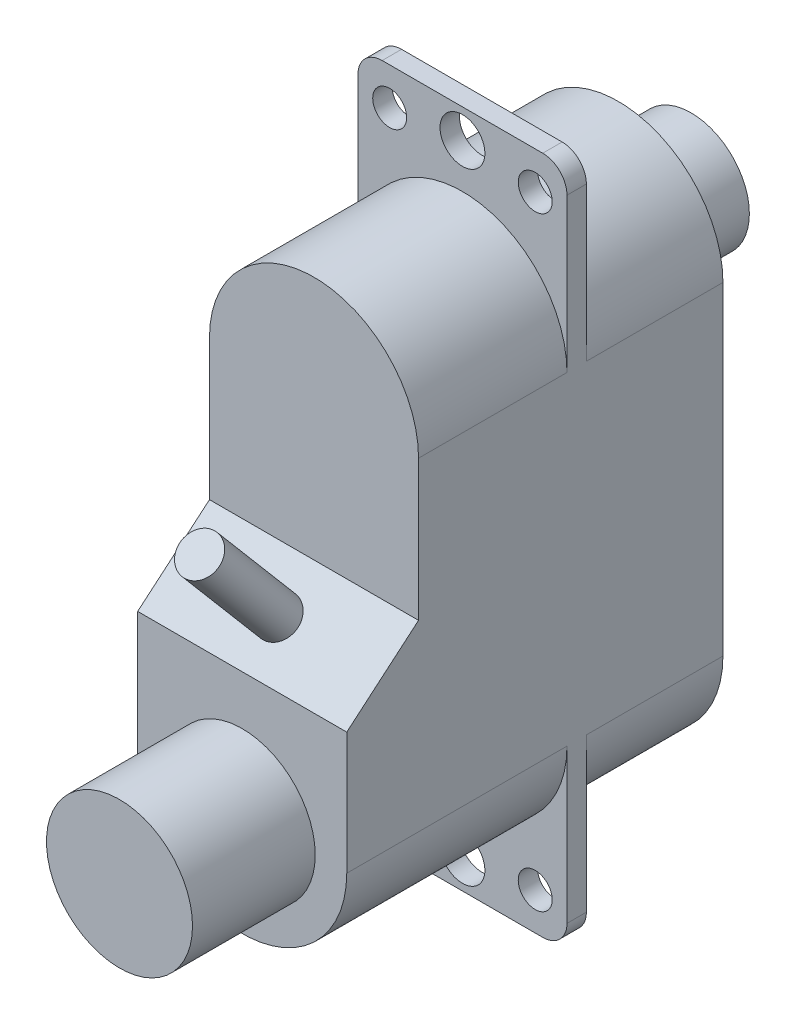
ISO-10303-21;
HEADER;
FILE_DESCRIPTION(('STEP AP214'),'2;1');
FILE_NAME('part.step','',(''),(''),'','','');
FILE_SCHEMA(('AUTOMOTIVE_DESIGN { 1 0 10303 214 1 1 1 1 }'));
ENDSEC;
DATA;
#1=APPLICATION_CONTEXT('core data for automotive mechanical design processes');
#2=APPLICATION_PROTOCOL_DEFINITION('international standard','automotive_design',2000,#1);
#3=PRODUCT_CONTEXT('',#1,'mechanical');
#4=PRODUCT('Part','Part','',(#3));
#5=PRODUCT_RELATED_PRODUCT_CATEGORY('part','',(#4));
#6=PRODUCT_DEFINITION_FORMATION('','',#4);
#7=PRODUCT_DEFINITION_CONTEXT('part definition',#1,'design');
#8=PRODUCT_DEFINITION('design','',#6,#7);
#9=PRODUCT_DEFINITION_SHAPE('','',#8);
#10=(LENGTH_UNIT() NAMED_UNIT(*) SI_UNIT(.MILLI.,.METRE.));
#11=(NAMED_UNIT(*) PLANE_ANGLE_UNIT() SI_UNIT($,.RADIAN.));
#12=(NAMED_UNIT(*) SI_UNIT($,.STERADIAN.) SOLID_ANGLE_UNIT());
#13=UNCERTAINTY_MEASURE_WITH_UNIT(LENGTH_MEASURE(1.E-05),#10,'distance_accuracy_value','');
#14=(GEOMETRIC_REPRESENTATION_CONTEXT(3) GLOBAL_UNCERTAINTY_ASSIGNED_CONTEXT((#13)) GLOBAL_UNIT_ASSIGNED_CONTEXT((#10,
#11,#12)) REPRESENTATION_CONTEXT('',''));
#15=CARTESIAN_POINT('',(0.,0.,0.));
#16=DIRECTION('',(0.,0.,1.));
#17=DIRECTION('',(1.,0.,0.));
#18=AXIS2_PLACEMENT_3D('',#15,#16,#17);
#19=CARTESIAN_POINT('',(0.,0.,18.51));
#20=DIRECTION('',(0.,0.,-1.));
#21=DIRECTION('',(-1.,0.,0.));
#22=AXIS2_PLACEMENT_3D('',#19,#20,#21);
#23=CYLINDRICAL_SURFACE('',#22,4.31);
#24=CARTESIAN_POINT('',(0.,0.,9.43));
#25=DIRECTION('',(0.,0.,-1.));
#26=DIRECTION('',(-1.,0.,0.));
#27=AXIS2_PLACEMENT_3D('',#24,#25,#26);
#28=CIRCLE('',#27,4.31);
#29=CARTESIAN_POINT('',(-4.31,0.,9.43));
#30=VERTEX_POINT('',#29);
#31=CARTESIAN_POINT('',(4.31,0.,9.43));
#32=VERTEX_POINT('',#31);
#33=EDGE_CURVE('E294',#30,#32,#28,.T.);
#34=ORIENTED_EDGE('',*,*,#33,.F.);
#35=DIRECTION('',(0.,0.,-1.));
#36=VECTOR('',#35,1.);
#37=CARTESIAN_POINT('',(-4.31,0.,18.51));
#38=LINE('',#37,#36);
#39=CARTESIAN_POINT('',(-4.31,0.,15.55));
#40=VERTEX_POINT('',#39);
#41=EDGE_CURVE('E372',#40,#30,#38,.T.);
#42=ORIENTED_EDGE('',*,*,#41,.F.);
#43=CARTESIAN_POINT('',(0.,0.,15.55));
#44=DIRECTION('',(0.,0.,-1.));
#45=DIRECTION('',(0.,1.,0.));
#46=AXIS2_PLACEMENT_3D('',#43,#44,#45);
#47=CIRCLE('',#46,4.31);
#48=CARTESIAN_POINT('',(4.31,0.,15.55));
#49=VERTEX_POINT('',#48);
#50=EDGE_CURVE('E325',#40,#49,#47,.T.);
#51=ORIENTED_EDGE('',*,*,#50,.T.);
#52=DIRECTION('',(0.,0.,-1.));
#53=VECTOR('',#52,1.);
#54=CARTESIAN_POINT('',(4.31,0.,18.51));
#55=LINE('',#54,#53);
#56=EDGE_CURVE('E357',#49,#32,#55,.T.);
#57=ORIENTED_EDGE('',*,*,#56,.T.);
#58=EDGE_LOOP('',(#34,#42,#51,#57));
#59=FACE_BOUND('',#58,.T.);
#60=ADVANCED_FACE('F52',(#59),#23,.T.);
#61=CARTESIAN_POINT('',(0.,-13.34,18.51));
#62=DIRECTION('',(0.,0.,-1.));
#63=DIRECTION('',(-1.,0.,0.));
#64=AXIS2_PLACEMENT_3D('',#61,#62,#63);
#65=CYLINDRICAL_SURFACE('',#64,4.31);
#66=CARTESIAN_POINT('',(0.,-13.34,9.43));
#67=DIRECTION('',(0.,0.,-1.));
#68=DIRECTION('',(-1.,0.,0.));
#69=AXIS2_PLACEMENT_3D('',#66,#67,#68);
#70=CIRCLE('',#69,4.31);
#71=CARTESIAN_POINT('',(4.31,-13.34,9.43));
#72=VERTEX_POINT('',#71);
#73=CARTESIAN_POINT('',(-4.31,-13.34,9.43));
#74=VERTEX_POINT('',#73);
#75=EDGE_CURVE('E291',#72,#74,#70,.T.);
#76=ORIENTED_EDGE('',*,*,#75,.F.);
#77=DIRECTION('',(0.,0.,-1.));
#78=VECTOR('',#77,1.);
#79=CARTESIAN_POINT('',(4.31,-13.34,18.51));
#80=LINE('',#79,#78);
#81=CARTESIAN_POINT('',(4.31,-13.34,18.51));
#82=VERTEX_POINT('',#81);
#83=EDGE_CURVE('E362',#82,#72,#80,.T.);
#84=ORIENTED_EDGE('',*,*,#83,.F.);
#85=CARTESIAN_POINT('',(0.,-13.34,18.51));
#86=DIRECTION('',(0.,0.,1.));
#87=DIRECTION('',(1.,0.,0.));
#88=AXIS2_PLACEMENT_3D('',#85,#86,#87);
#89=CIRCLE('',#88,4.31);
#90=CARTESIAN_POINT('',(-4.31,-13.34,18.51));
#91=VERTEX_POINT('',#90);
#92=EDGE_CURVE('E334',#91,#82,#89,.T.);
#93=ORIENTED_EDGE('',*,*,#92,.F.);
#94=DIRECTION('',(0.,0.,-1.));
#95=VECTOR('',#94,1.);
#96=CARTESIAN_POINT('',(-4.31,-13.34,18.51));
#97=LINE('',#96,#95);
#98=EDGE_CURVE('E367',#91,#74,#97,.T.);
#99=ORIENTED_EDGE('',*,*,#98,.T.);
#100=EDGE_LOOP('',(#76,#84,#93,#99));
#101=FACE_BOUND('',#100,.T.);
#102=ADVANCED_FACE('F396',(#101),#65,.T.);
#103=CARTESIAN_POINT('',(0.,0.,3.));
#104=DIRECTION('',(0.,0.,-1.));
#105=DIRECTION('',(-1.,0.,0.));
#106=AXIS2_PLACEMENT_3D('',#103,#104,#105);
#107=CYLINDRICAL_SURFACE('',#106,2.4);
#108=CARTESIAN_POINT('',(0.,0.,3.));
#109=DIRECTION('',(0.,0.,1.));
#110=DIRECTION('',(1.,0.,0.));
#111=AXIS2_PLACEMENT_3D('',#108,#109,#110);
#112=CIRCLE('',#111,2.4);
#113=CARTESIAN_POINT('',(2.4,0.,3.));
#114=VERTEX_POINT('',#113);
#115=EDGE_CURVE('E61',#114,#114,#112,.T.);
#116=ORIENTED_EDGE('',*,*,#115,.F.);
#117=EDGE_LOOP('',(#116));
#118=FACE_BOUND('',#117,.T.);
#119=CARTESIAN_POINT('',(0.,0.,0.));
#120=DIRECTION('',(0.,0.,1.));
#121=DIRECTION('',(1.,0.,0.));
#122=AXIS2_PLACEMENT_3D('',#119,#120,#121);
#123=CIRCLE('',#122,2.4);
#124=CARTESIAN_POINT('',(2.4,0.,0.));
#125=VERTEX_POINT('',#124);
#126=EDGE_CURVE('E376',#125,#125,#123,.T.);
#127=ORIENTED_EDGE('',*,*,#126,.T.);
#128=EDGE_LOOP('',(#127));
#129=FACE_BOUND('',#128,.T.);
#130=ADVANCED_FACE('F54',(#118,#129),#107,.T.);
#131=CARTESIAN_POINT('',(0.,0.,0.));
#132=DIRECTION('',(0.,0.,1.));
#133=DIRECTION('',(1.,0.,0.));
#134=AXIS2_PLACEMENT_3D('',#131,#132,#133);
#135=PLANE('',#134);
#136=ORIENTED_EDGE('',*,*,#126,.F.);
#137=EDGE_LOOP('',(#136));
#138=FACE_BOUND('',#137,.T.);
#139=ADVANCED_FACE('F386',(#138),#135,.F.);
#140=CARTESIAN_POINT('',(-4.31,0.,8.63));
#141=VERTEX_POINT('',#140);
#142=CARTESIAN_POINT('',(-4.31,0.,3.));
#143=VERTEX_POINT('',#142);
#144=EDGE_CURVE('E371',#141,#143,#38,.T.);
#145=ORIENTED_EDGE('',*,*,#144,.F.);
#146=CARTESIAN_POINT('',(0.,0.,8.63));
#147=DIRECTION('',(0.,0.,-1.));
#148=DIRECTION('',(-1.,0.,0.));
#149=AXIS2_PLACEMENT_3D('',#146,#147,#148);
#150=CIRCLE('',#149,4.31);
#151=CARTESIAN_POINT('',(4.31,0.,8.63));
#152=VERTEX_POINT('',#151);
#153=EDGE_CURVE('E288',#141,#152,#150,.T.);
#154=ORIENTED_EDGE('',*,*,#153,.T.);
#155=CARTESIAN_POINT('',(4.31,0.,3.));
#156=VERTEX_POINT('',#155);
#157=EDGE_CURVE('E342',#152,#156,#55,.T.);
#158=ORIENTED_EDGE('',*,*,#157,.T.);
#159=CARTESIAN_POINT('',(0.,0.,3.));
#160=DIRECTION('',(0.,0.,1.));
#161=DIRECTION('',(1.,0.,0.));
#162=AXIS2_PLACEMENT_3D('',#159,#160,#161);
#163=CIRCLE('',#162,4.31);
#164=EDGE_CURVE('E330',#156,#143,#163,.T.);
#165=ORIENTED_EDGE('',*,*,#164,.T.);
#166=EDGE_LOOP('',(#145,#154,#158,#165));
#167=FACE_BOUND('',#166,.T.);
#168=ADVANCED_FACE('F388',(#167),#23,.T.);
#169=CARTESIAN_POINT('',(-4.31,0.,18.51));
#170=DIRECTION('',(1.,0.,0.));
#171=DIRECTION('',(0.,1.,0.));
#172=AXIS2_PLACEMENT_3D('',#169,#170,#171);
#173=PLANE('',#172);
#174=CARTESIAN_POINT('',(-4.31,-13.34,8.63));
#175=VERTEX_POINT('',#174);
#176=CARTESIAN_POINT('',(-4.31,-13.34,3.));
#177=VERTEX_POINT('',#176);
#178=EDGE_CURVE('E366',#175,#177,#97,.T.);
#179=ORIENTED_EDGE('',*,*,#178,.F.);
#180=DIRECTION('',(0.,1.,0.));
#181=VECTOR('',#180,1.);
#182=CARTESIAN_POINT('',(-4.31,6.33,8.63));
#183=LINE('',#182,#181);
#184=CARTESIAN_POINT('',(-4.31,-19.67,8.63));
#185=VERTEX_POINT('',#184);
#186=EDGE_CURVE('E68',#185,#175,#183,.T.);
#187=ORIENTED_EDGE('',*,*,#186,.F.);
#188=DIRECTION('',(0.,0.,-1.));
#189=VECTOR('',#188,1.);
#190=CARTESIAN_POINT('',(-4.31,-19.67,9.43));
#191=LINE('',#190,#189);
#192=CARTESIAN_POINT('',(-4.31,-19.67,9.43));
#193=VERTEX_POINT('',#192);
#194=EDGE_CURVE('E281',#193,#185,#191,.T.);
#195=ORIENTED_EDGE('',*,*,#194,.F.);
#196=DIRECTION('',(0.,1.,0.));
#197=VECTOR('',#196,1.);
#198=CARTESIAN_POINT('',(-4.31,6.33,9.43));
#199=LINE('',#198,#197);
#200=EDGE_CURVE('E222',#193,#74,#199,.T.);
#201=ORIENTED_EDGE('',*,*,#200,.T.);
#202=ORIENTED_EDGE('',*,*,#98,.F.);
#203=DIRECTION('',(0.,-1.,0.));
#204=VECTOR('',#203,1.);
#205=CARTESIAN_POINT('',(-4.31,0.,18.51));
#206=LINE('',#205,#204);
#207=CARTESIAN_POINT('',(-4.31,-8.3,18.51));
#208=VERTEX_POINT('',#207);
#209=EDGE_CURVE('E331',#208,#91,#206,.T.);
#210=ORIENTED_EDGE('',*,*,#209,.F.);
#211=DIRECTION('',(0.,0.646750428249599,-0.762701700246538));
#212=VECTOR('',#211,1.);
#213=CARTESIAN_POINT('',(-4.31,-5.79,15.55));
#214=LINE('',#213,#212);
#215=CARTESIAN_POINT('',(-4.31,-5.79,15.55));
#216=VERTEX_POINT('',#215);
#217=EDGE_CURVE('E313',#208,#216,#214,.T.);
#218=ORIENTED_EDGE('',*,*,#217,.T.);
#219=DIRECTION('',(0.,1.,0.));
#220=VECTOR('',#219,1.);
#221=CARTESIAN_POINT('',(-4.31,4.31,15.55));
#222=LINE('',#221,#220);
#223=EDGE_CURVE('E317',#216,#40,#222,.T.);
#224=ORIENTED_EDGE('',*,*,#223,.T.);
#225=ORIENTED_EDGE('',*,*,#41,.T.);
#226=CARTESIAN_POINT('',(-4.31,6.33,9.43));
#227=VERTEX_POINT('',#226);
#228=EDGE_CURVE('E221',#30,#227,#199,.T.);
#229=ORIENTED_EDGE('',*,*,#228,.T.);
#230=DIRECTION('',(0.,0.,-1.));
#231=VECTOR('',#230,1.);
#232=CARTESIAN_POINT('',(-4.31,6.33,9.43));
#233=LINE('',#232,#231);
#234=CARTESIAN_POINT('',(-4.31,6.33,8.63));
#235=VERTEX_POINT('',#234);
#236=EDGE_CURVE('E277',#227,#235,#233,.T.);
#237=ORIENTED_EDGE('',*,*,#236,.T.);
#238=EDGE_CURVE('E251',#141,#235,#183,.T.);
#239=ORIENTED_EDGE('',*,*,#238,.F.);
#240=ORIENTED_EDGE('',*,*,#144,.T.);
#241=DIRECTION('',(0.,-1.,0.));
#242=VECTOR('',#241,1.);
#243=CARTESIAN_POINT('',(-4.31,0.,3.));
#244=LINE('',#243,#242);
#245=EDGE_CURVE('E346',#143,#177,#244,.T.);
#246=ORIENTED_EDGE('',*,*,#245,.T.);
#247=EDGE_LOOP('',(#179,#187,#195,#201,#202,#210,#218,#224,#225,#229,#237,#239,#240,#246));
#248=FACE_BOUND('',#247,.T.);
#249=ADVANCED_FACE('F393',(#248),#173,.F.);
#250=CARTESIAN_POINT('',(4.31,-13.34,8.63));
#251=VERTEX_POINT('',#250);
#252=CARTESIAN_POINT('',(4.31,-13.34,3.));
#253=VERTEX_POINT('',#252);
#254=EDGE_CURVE('E361',#251,#253,#80,.T.);
#255=ORIENTED_EDGE('',*,*,#254,.F.);
#256=CARTESIAN_POINT('',(0.,-13.34,8.63));
#257=DIRECTION('',(0.,0.,-1.));
#258=DIRECTION('',(-1.,0.,0.));
#259=AXIS2_PLACEMENT_3D('',#256,#257,#258);
#260=CIRCLE('',#259,4.31);
#261=EDGE_CURVE('E267',#251,#175,#260,.T.);
#262=ORIENTED_EDGE('',*,*,#261,.T.);
#263=ORIENTED_EDGE('',*,*,#178,.T.);
#264=CARTESIAN_POINT('',(0.,-13.34,3.));
#265=DIRECTION('',(0.,0.,1.));
#266=DIRECTION('',(1.,0.,0.));
#267=AXIS2_PLACEMENT_3D('',#264,#265,#266);
#268=CIRCLE('',#267,4.31);
#269=EDGE_CURVE('E350',#177,#253,#268,.T.);
#270=ORIENTED_EDGE('',*,*,#269,.T.);
#271=EDGE_LOOP('',(#255,#262,#263,#270));
#272=FACE_BOUND('',#271,.T.);
#273=ADVANCED_FACE('F405',(#272),#65,.T.);
#274=CARTESIAN_POINT('',(4.31,0.,18.51));
#275=DIRECTION('',(-1.,0.,0.));
#276=DIRECTION('',(0.,-1.,0.));
#277=AXIS2_PLACEMENT_3D('',#274,#275,#276);
#278=PLANE('',#277);
#279=ORIENTED_EDGE('',*,*,#157,.F.);
#280=DIRECTION('',(0.,-1.,0.));
#281=VECTOR('',#280,1.);
#282=CARTESIAN_POINT('',(4.31,6.33,8.63));
#283=LINE('',#282,#281);
#284=CARTESIAN_POINT('',(4.31,6.33,8.63));
#285=VERTEX_POINT('',#284);
#286=EDGE_CURVE('E76',#285,#152,#283,.T.);
#287=ORIENTED_EDGE('',*,*,#286,.F.);
#288=DIRECTION('',(0.,0.,-1.));
#289=VECTOR('',#288,1.);
#290=CARTESIAN_POINT('',(4.31,6.33,9.43));
#291=LINE('',#290,#289);
#292=CARTESIAN_POINT('',(4.31,6.33,9.43));
#293=VERTEX_POINT('',#292);
#294=EDGE_CURVE('E268',#293,#285,#291,.T.);
#295=ORIENTED_EDGE('',*,*,#294,.F.);
#296=DIRECTION('',(0.,-1.,0.));
#297=VECTOR('',#296,1.);
#298=CARTESIAN_POINT('',(4.31,6.33,9.43));
#299=LINE('',#298,#297);
#300=EDGE_CURVE('E192',#293,#32,#299,.T.);
#301=ORIENTED_EDGE('',*,*,#300,.T.);
#302=ORIENTED_EDGE('',*,*,#56,.F.);
#303=DIRECTION('',(0.,1.,0.));
#304=VECTOR('',#303,1.);
#305=CARTESIAN_POINT('',(4.31,4.31,15.55));
#306=LINE('',#305,#304);
#307=CARTESIAN_POINT('',(4.31,-5.79,15.55));
#308=VERTEX_POINT('',#307);
#309=EDGE_CURVE('E309',#308,#49,#306,.T.);
#310=ORIENTED_EDGE('',*,*,#309,.F.);
#311=DIRECTION('',(0.,0.646750428249599,-0.762701700246538));
#312=VECTOR('',#311,1.);
#313=CARTESIAN_POINT('',(4.31,-5.79,15.55));
#314=LINE('',#313,#312);
#315=CARTESIAN_POINT('',(4.31,-8.3,18.51));
#316=VERTEX_POINT('',#315);
#317=EDGE_CURVE('E302',#316,#308,#314,.T.);
#318=ORIENTED_EDGE('',*,*,#317,.F.);
#319=DIRECTION('',(0.,1.,0.));
#320=VECTOR('',#319,1.);
#321=CARTESIAN_POINT('',(4.31,0.,18.51));
#322=LINE('',#321,#320);
#323=EDGE_CURVE('E338',#82,#316,#322,.T.);
#324=ORIENTED_EDGE('',*,*,#323,.F.);
#325=ORIENTED_EDGE('',*,*,#83,.T.);
#326=CARTESIAN_POINT('',(4.31,-19.67,9.43));
#327=VERTEX_POINT('',#326);
#328=EDGE_CURVE('E238',#72,#327,#299,.T.);
#329=ORIENTED_EDGE('',*,*,#328,.T.);
#330=DIRECTION('',(0.,0.,-1.));
#331=VECTOR('',#330,1.);
#332=CARTESIAN_POINT('',(4.31,-19.67,9.43));
#333=LINE('',#332,#331);
#334=CARTESIAN_POINT('',(4.31,-19.67,8.63));
#335=VERTEX_POINT('',#334);
#336=EDGE_CURVE('E207',#327,#335,#333,.T.);
#337=ORIENTED_EDGE('',*,*,#336,.T.);
#338=EDGE_CURVE('E213',#251,#335,#283,.T.);
#339=ORIENTED_EDGE('',*,*,#338,.F.);
#340=ORIENTED_EDGE('',*,*,#254,.T.);
#341=DIRECTION('',(0.,1.,0.));
#342=VECTOR('',#341,1.);
#343=CARTESIAN_POINT('',(4.31,0.,3.));
#344=LINE('',#343,#342);
#345=EDGE_CURVE('E335',#253,#156,#344,.T.);
#346=ORIENTED_EDGE('',*,*,#345,.T.);
#347=EDGE_LOOP('',(#279,#287,#295,#301,#302,#310,#318,#324,#325,#329,#337,#339,#340,#346));
#348=FACE_BOUND('',#347,.T.);
#349=ADVANCED_FACE('F412',(#348),#278,.F.);
#350=CARTESIAN_POINT('',(0.,0.,18.51));
#351=DIRECTION('',(0.,0.,1.));
#352=DIRECTION('',(1.,0.,0.));
#353=AXIS2_PLACEMENT_3D('',#350,#351,#352);
#354=PLANE('',#353);
#355=CARTESIAN_POINT('',(0.,-13.34,18.51));
#356=DIRECTION('',(0.,0.,1.));
#357=DIRECTION('',(1.,0.,0.));
#358=AXIS2_PLACEMENT_3D('',#355,#356,#357);
#359=CIRCLE('',#358,3.01);
#360=CARTESIAN_POINT('',(3.01,-13.34,18.51));
#361=VERTEX_POINT('',#360);
#362=EDGE_CURVE('E297',#361,#361,#359,.T.);
#363=ORIENTED_EDGE('',*,*,#362,.F.);
#364=EDGE_LOOP('',(#363));
#365=FACE_BOUND('',#364,.T.);
#366=DIRECTION('',(1.,0.,0.));
#367=VECTOR('',#366,1.);
#368=CARTESIAN_POINT('',(-4.31,-8.3,18.51));
#369=LINE('',#368,#367);
#370=EDGE_CURVE('E321',#208,#316,#369,.T.);
#371=ORIENTED_EDGE('',*,*,#370,.F.);
#372=ORIENTED_EDGE('',*,*,#209,.T.);
#373=ORIENTED_EDGE('',*,*,#92,.T.);
#374=ORIENTED_EDGE('',*,*,#323,.T.);
#375=EDGE_LOOP('',(#371,#372,#373,#374));
#376=FACE_BOUND('',#375,.T.);
#377=ADVANCED_FACE('F416',(#365,#376),#354,.T.);
#378=CARTESIAN_POINT('',(0.,0.,3.));
#379=DIRECTION('',(0.,0.,1.));
#380=DIRECTION('',(1.,0.,0.));
#381=AXIS2_PLACEMENT_3D('',#378,#379,#380);
#382=PLANE('',#381);
#383=ORIENTED_EDGE('',*,*,#115,.T.);
#384=EDGE_LOOP('',(#383));
#385=FACE_BOUND('',#384,.T.);
#386=ORIENTED_EDGE('',*,*,#164,.F.);
#387=ORIENTED_EDGE('',*,*,#345,.F.);
#388=ORIENTED_EDGE('',*,*,#269,.F.);
#389=ORIENTED_EDGE('',*,*,#245,.F.);
#390=EDGE_LOOP('',(#386,#387,#388,#389));
#391=FACE_BOUND('',#390,.T.);
#392=ADVANCED_FACE('F418',(#385,#391),#382,.F.);
#393=CARTESIAN_POINT('',(-4.31,4.31,15.55));
#394=DIRECTION('',(0.,0.,-1.));
#395=DIRECTION('',(0.,1.,0.));
#396=AXIS2_PLACEMENT_3D('',#393,#394,#395);
#397=PLANE('',#396);
#398=ORIENTED_EDGE('',*,*,#50,.F.);
#399=ORIENTED_EDGE('',*,*,#223,.F.);
#400=DIRECTION('',(1.,0.,0.));
#401=VECTOR('',#400,1.);
#402=CARTESIAN_POINT('',(-4.31,-5.79,15.55));
#403=LINE('',#402,#401);
#404=EDGE_CURVE('E322',#216,#308,#403,.T.);
#405=ORIENTED_EDGE('',*,*,#404,.T.);
#406=ORIENTED_EDGE('',*,*,#309,.T.);
#407=EDGE_LOOP('',(#398,#399,#405,#406));
#408=FACE_BOUND('',#407,.T.);
#409=ADVANCED_FACE('F421',(#408),#397,.F.);
#410=CARTESIAN_POINT('',(-4.31,-5.79,15.55));
#411=DIRECTION('',(0.,-0.762701700246538,-0.646750428249599));
#412=DIRECTION('',(0.,0.646750428249599,-0.762701700246538));
#413=AXIS2_PLACEMENT_3D('',#410,#411,#412);
#414=PLANE('',#413);
#415=CARTESIAN_POINT('',(0.,-7.04841118991035,17.0340227578226));
#416=DIRECTION('',(0.,-0.762701700246538,-0.646750428249599));
#417=DIRECTION('',(0.,0.646750428249599,-0.762701700246538));
#418=AXIS2_PLACEMENT_3D('',#415,#416,#417);
#419=CIRCLE('',#418,0.823117728845187);
#420=CARTESIAN_POINT('',(0.,-6.51605944627989,16.4062294665293));
#421=VERTEX_POINT('',#420);
#422=EDGE_CURVE('E13',#421,#421,#419,.F.);
#423=ORIENTED_EDGE('',*,*,#422,.F.);
#424=EDGE_LOOP('',(#423));
#425=FACE_BOUND('',#424,.T.);
#426=ORIENTED_EDGE('',*,*,#404,.F.);
#427=ORIENTED_EDGE('',*,*,#217,.F.);
#428=ORIENTED_EDGE('',*,*,#370,.T.);
#429=ORIENTED_EDGE('',*,*,#317,.T.);
#430=EDGE_LOOP('',(#426,#427,#428,#429));
#431=FACE_BOUND('',#430,.T.);
#432=ADVANCED_FACE('F426',(#425,#431),#414,.F.);
#433=CARTESIAN_POINT('',(0.,-13.34,23.57));
#434=DIRECTION('',(0.,0.,-1.));
#435=DIRECTION('',(-1.,0.,0.));
#436=AXIS2_PLACEMENT_3D('',#433,#434,#435);
#437=CYLINDRICAL_SURFACE('',#436,3.01);
#438=CARTESIAN_POINT('',(0.,-13.34,23.57));
#439=DIRECTION('',(0.,0.,1.));
#440=DIRECTION('',(1.,0.,0.));
#441=AXIS2_PLACEMENT_3D('',#438,#439,#440);
#442=CIRCLE('',#441,3.01);
#443=CARTESIAN_POINT('',(3.01,-13.34,23.57));
#444=VERTEX_POINT('',#443);
#445=EDGE_CURVE('E298',#444,#444,#442,.T.);
#446=ORIENTED_EDGE('',*,*,#445,.F.);
#447=EDGE_LOOP('',(#446));
#448=FACE_BOUND('',#447,.T.);
#449=ORIENTED_EDGE('',*,*,#362,.T.);
#450=EDGE_LOOP('',(#449));
#451=FACE_BOUND('',#450,.T.);
#452=ADVANCED_FACE('F429',(#448,#451),#437,.T.);
#453=CARTESIAN_POINT('',(0.,-13.34,23.57));
#454=DIRECTION('',(0.,0.,1.));
#455=DIRECTION('',(1.,0.,0.));
#456=AXIS2_PLACEMENT_3D('',#453,#454,#455);
#457=PLANE('',#456);
#458=ORIENTED_EDGE('',*,*,#445,.T.);
#459=EDGE_LOOP('',(#458));
#460=FACE_BOUND('',#459,.T.);
#461=ADVANCED_FACE('F436',(#460),#457,.T.);
#462=CARTESIAN_POINT('',(-3.31,-19.67,9.43));
#463=DIRECTION('',(0.,0.,-1.));
#464=DIRECTION('',(-1.,0.,0.));
#465=AXIS2_PLACEMENT_3D('',#462,#463,#464);
#466=CYLINDRICAL_SURFACE('',#465,1.);
#467=CARTESIAN_POINT('',(-3.31,-19.67,8.63));
#468=DIRECTION('',(0.,0.,-1.));
#469=DIRECTION('',(-1.,0.,0.));
#470=AXIS2_PLACEMENT_3D('',#467,#468,#469);
#471=CIRCLE('',#470,1.);
#472=CARTESIAN_POINT('',(-3.31,-20.67,8.63));
#473=VERTEX_POINT('',#472);
#474=EDGE_CURVE('E248',#473,#185,#471,.T.);
#475=ORIENTED_EDGE('',*,*,#474,.F.);
#476=DIRECTION('',(0.,0.,-1.));
#477=VECTOR('',#476,1.);
#478=CARTESIAN_POINT('',(-3.31,-20.67,9.43));
#479=LINE('',#478,#477);
#480=CARTESIAN_POINT('',(-3.31,-20.67,9.43));
#481=VERTEX_POINT('',#480);
#482=EDGE_CURVE('E191',#481,#473,#479,.T.);
#483=ORIENTED_EDGE('',*,*,#482,.F.);
#484=CARTESIAN_POINT('',(-3.31,-19.67,9.43));
#485=DIRECTION('',(0.,0.,-1.));
#486=DIRECTION('',(-1.,0.,0.));
#487=AXIS2_PLACEMENT_3D('',#484,#485,#486);
#488=CIRCLE('',#487,1.);
#489=EDGE_CURVE('E201',#481,#193,#488,.T.);
#490=ORIENTED_EDGE('',*,*,#489,.T.);
#491=ORIENTED_EDGE('',*,*,#194,.T.);
#492=EDGE_LOOP('',(#475,#483,#490,#491));
#493=FACE_BOUND('',#492,.T.);
#494=ADVANCED_FACE('F440',(#493),#466,.T.);
#495=CARTESIAN_POINT('',(3.31,-20.67,9.43));
#496=DIRECTION('',(0.,-1.,0.));
#497=DIRECTION('',(1.,0.,0.));
#498=AXIS2_PLACEMENT_3D('',#495,#496,#497);
#499=PLANE('',#498);
#500=DIRECTION('',(-1.,0.,0.));
#501=VECTOR('',#500,1.);
#502=CARTESIAN_POINT('',(3.31,-20.67,8.63));
#503=LINE('',#502,#501);
#504=CARTESIAN_POINT('',(3.31,-20.67,8.63));
#505=VERTEX_POINT('',#504);
#506=EDGE_CURVE('E185',#505,#473,#503,.T.);
#507=ORIENTED_EDGE('',*,*,#506,.F.);
#508=DIRECTION('',(0.,0.,-1.));
#509=VECTOR('',#508,1.);
#510=CARTESIAN_POINT('',(3.31,-20.67,9.43));
#511=LINE('',#510,#509);
#512=CARTESIAN_POINT('',(3.31,-20.67,9.43));
#513=VERTEX_POINT('',#512);
#514=EDGE_CURVE('E180',#513,#505,#511,.T.);
#515=ORIENTED_EDGE('',*,*,#514,.F.);
#516=DIRECTION('',(-1.,0.,0.));
#517=VECTOR('',#516,1.);
#518=CARTESIAN_POINT('',(3.31,-20.67,9.43));
#519=LINE('',#518,#517);
#520=EDGE_CURVE('E183',#513,#481,#519,.T.);
#521=ORIENTED_EDGE('',*,*,#520,.T.);
#522=ORIENTED_EDGE('',*,*,#482,.T.);
#523=EDGE_LOOP('',(#507,#515,#521,#522));
#524=FACE_BOUND('',#523,.T.);
#525=ADVANCED_FACE('F182',(#524),#499,.T.);
#526=CARTESIAN_POINT('',(3.31,-19.67,9.43));
#527=DIRECTION('',(0.,0.,-1.));
#528=DIRECTION('',(-1.,0.,0.));
#529=AXIS2_PLACEMENT_3D('',#526,#527,#528);
#530=CYLINDRICAL_SURFACE('',#529,1.);
#531=CARTESIAN_POINT('',(3.31,-19.67,8.63));
#532=DIRECTION('',(0.,0.,-1.));
#533=DIRECTION('',(-1.,0.,0.));
#534=AXIS2_PLACEMENT_3D('',#531,#532,#533);
#535=CIRCLE('',#534,1.);
#536=EDGE_CURVE('E242',#335,#505,#535,.T.);
#537=ORIENTED_EDGE('',*,*,#536,.F.);
#538=ORIENTED_EDGE('',*,*,#336,.F.);
#539=CARTESIAN_POINT('',(3.31,-19.67,9.43));
#540=DIRECTION('',(0.,0.,-1.));
#541=DIRECTION('',(-1.,0.,0.));
#542=AXIS2_PLACEMENT_3D('',#539,#540,#541);
#543=CIRCLE('',#542,1.);
#544=EDGE_CURVE('E198',#327,#513,#543,.T.);
#545=ORIENTED_EDGE('',*,*,#544,.T.);
#546=ORIENTED_EDGE('',*,*,#514,.T.);
#547=EDGE_LOOP('',(#537,#538,#545,#546));
#548=FACE_BOUND('',#547,.T.);
#549=ADVANCED_FACE('F205',(#548),#530,.T.);
#550=CARTESIAN_POINT('',(3.,-19.1307638100292,9.43));
#551=DIRECTION('',(0.,0.,-1.));
#552=DIRECTION('',(-1.,0.,0.));
#553=AXIS2_PLACEMENT_3D('',#550,#551,#552);
#554=CYLINDRICAL_SURFACE('',#553,0.699999999999999);
#555=CARTESIAN_POINT('',(3.,-19.1307638100292,9.43));
#556=DIRECTION('',(0.,0.,-1.));
#557=DIRECTION('',(-1.,0.,0.));
#558=AXIS2_PLACEMENT_3D('',#555,#556,#557);
#559=CIRCLE('',#558,0.699999999999999);
#560=CARTESIAN_POINT('',(2.3,-19.1307638100292,9.43));
#561=VERTEX_POINT('',#560);
#562=EDGE_CURVE('E511',#561,#561,#559,.T.);
#563=ORIENTED_EDGE('',*,*,#562,.F.);
#564=EDGE_LOOP('',(#563));
#565=FACE_BOUND('',#564,.T.);
#566=CARTESIAN_POINT('',(3.,-19.1307638100292,8.63));
#567=DIRECTION('',(0.,0.,-1.));
#568=DIRECTION('',(-1.,0.,0.));
#569=AXIS2_PLACEMENT_3D('',#566,#567,#568);
#570=CIRCLE('',#569,0.699999999999999);
#571=CARTESIAN_POINT('',(2.3,-19.1307638100292,8.63));
#572=VERTEX_POINT('',#571);
#573=EDGE_CURVE('E507',#572,#572,#570,.T.);
#574=ORIENTED_EDGE('',*,*,#573,.T.);
#575=EDGE_LOOP('',(#574));
#576=FACE_BOUND('',#575,.T.);
#577=ADVANCED_FACE('F444',(#565,#576),#554,.F.);
#578=CARTESIAN_POINT('',(0.,-19.47,9.43));
#579=DIRECTION('',(0.,0.,-1.));
#580=DIRECTION('',(-1.,0.,0.));
#581=AXIS2_PLACEMENT_3D('',#578,#579,#580);
#582=CYLINDRICAL_SURFACE('',#581,0.924999999999999);
#583=CARTESIAN_POINT('',(0.,-19.47,9.43));
#584=DIRECTION('',(0.,0.,-1.));
#585=DIRECTION('',(1.,0.,0.));
#586=AXIS2_PLACEMENT_3D('',#583,#584,#585);
#587=CIRCLE('',#586,0.924999999999999);
#588=CARTESIAN_POINT('',(0.924999999999999,-19.47,9.43));
#589=VERTEX_POINT('',#588);
#590=EDGE_CURVE('E518',#589,#589,#587,.T.);
#591=ORIENTED_EDGE('',*,*,#590,.F.);
#592=EDGE_LOOP('',(#591));
#593=FACE_BOUND('',#592,.T.);
#594=CARTESIAN_POINT('',(0.,-19.47,8.63));
#595=DIRECTION('',(0.,0.,-1.));
#596=DIRECTION('',(1.,0.,0.));
#597=AXIS2_PLACEMENT_3D('',#594,#595,#596);
#598=CIRCLE('',#597,0.924999999999999);
#599=CARTESIAN_POINT('',(0.924999999999999,-19.47,8.63));
#600=VERTEX_POINT('',#599);
#601=EDGE_CURVE('E516',#600,#600,#598,.T.);
#602=ORIENTED_EDGE('',*,*,#601,.T.);
#603=EDGE_LOOP('',(#602));
#604=FACE_BOUND('',#603,.T.);
#605=ADVANCED_FACE('F487',(#593,#604),#582,.F.);
#606=CARTESIAN_POINT('',(-3.,-19.1307638100292,9.43));
#607=DIRECTION('',(0.,0.,-1.));
#608=DIRECTION('',(-1.,0.,0.));
#609=AXIS2_PLACEMENT_3D('',#606,#607,#608);
#610=CYLINDRICAL_SURFACE('',#609,0.699999999999999);
#611=CARTESIAN_POINT('',(-3.,-19.1307638100292,9.43));
#612=DIRECTION('',(0.,0.,-1.));
#613=DIRECTION('',(1.,0.,0.));
#614=AXIS2_PLACEMENT_3D('',#611,#612,#613);
#615=CIRCLE('',#614,0.699999999999999);
#616=CARTESIAN_POINT('',(-2.3,-19.1307638100292,9.43));
#617=VERTEX_POINT('',#616);
#618=EDGE_CURVE('E526',#617,#617,#615,.T.);
#619=ORIENTED_EDGE('',*,*,#618,.F.);
#620=EDGE_LOOP('',(#619));
#621=FACE_BOUND('',#620,.T.);
#622=CARTESIAN_POINT('',(-3.,-19.1307638100292,8.63));
#623=DIRECTION('',(0.,0.,-1.));
#624=DIRECTION('',(1.,0.,0.));
#625=AXIS2_PLACEMENT_3D('',#622,#623,#624);
#626=CIRCLE('',#625,0.699999999999999);
#627=CARTESIAN_POINT('',(-2.3,-19.1307638100292,8.63));
#628=VERTEX_POINT('',#627);
#629=EDGE_CURVE('E522',#628,#628,#626,.T.);
#630=ORIENTED_EDGE('',*,*,#629,.T.);
#631=EDGE_LOOP('',(#630));
#632=FACE_BOUND('',#631,.T.);
#633=ADVANCED_FACE('F484',(#621,#632),#610,.F.);
#634=CARTESIAN_POINT('',(3.31,-19.67,8.63));
#635=DIRECTION('',(0.,0.,-1.));
#636=DIRECTION('',(-1.,0.,0.));
#637=AXIS2_PLACEMENT_3D('',#634,#635,#636);
#638=PLANE('',#637);
#639=ORIENTED_EDGE('',*,*,#629,.F.);
#640=EDGE_LOOP('',(#639));
#641=FACE_BOUND('',#640,.T.);
#642=ORIENTED_EDGE('',*,*,#601,.F.);
#643=EDGE_LOOP('',(#642));
#644=FACE_BOUND('',#643,.T.);
#645=ORIENTED_EDGE('',*,*,#573,.F.);
#646=EDGE_LOOP('',(#645));
#647=FACE_BOUND('',#646,.T.);
#648=ORIENTED_EDGE('',*,*,#261,.F.);
#649=ORIENTED_EDGE('',*,*,#338,.T.);
#650=ORIENTED_EDGE('',*,*,#536,.T.);
#651=ORIENTED_EDGE('',*,*,#506,.T.);
#652=ORIENTED_EDGE('',*,*,#474,.T.);
#653=ORIENTED_EDGE('',*,*,#186,.T.);
#654=EDGE_LOOP('',(#648,#649,#650,#651,#652,#653));
#655=FACE_BOUND('',#654,.T.);
#656=ADVANCED_FACE('F468',(#641,#644,#647,#655),#638,.T.);
#657=CARTESIAN_POINT('',(3.31,-19.67,9.43));
#658=DIRECTION('',(0.,0.,-1.));
#659=DIRECTION('',(-1.,0.,0.));
#660=AXIS2_PLACEMENT_3D('',#657,#658,#659);
#661=PLANE('',#660);
#662=ORIENTED_EDGE('',*,*,#618,.T.);
#663=EDGE_LOOP('',(#662));
#664=FACE_BOUND('',#663,.T.);
#665=ORIENTED_EDGE('',*,*,#590,.T.);
#666=EDGE_LOOP('',(#665));
#667=FACE_BOUND('',#666,.T.);
#668=ORIENTED_EDGE('',*,*,#562,.T.);
#669=EDGE_LOOP('',(#668));
#670=FACE_BOUND('',#669,.T.);
#671=ORIENTED_EDGE('',*,*,#328,.F.);
#672=ORIENTED_EDGE('',*,*,#75,.T.);
#673=ORIENTED_EDGE('',*,*,#200,.F.);
#674=ORIENTED_EDGE('',*,*,#489,.F.);
#675=ORIENTED_EDGE('',*,*,#520,.F.);
#676=ORIENTED_EDGE('',*,*,#544,.F.);
#677=EDGE_LOOP('',(#671,#672,#673,#674,#675,#676));
#678=FACE_BOUND('',#677,.T.);
#679=ADVANCED_FACE('F197',(#664,#667,#670,#678),#661,.F.);
#680=CARTESIAN_POINT('',(3.,5.79076381002915,9.43));
#681=DIRECTION('',(0.,0.,-1.));
#682=DIRECTION('',(1.,0.,0.));
#683=AXIS2_PLACEMENT_3D('',#680,#681,#682);
#684=CIRCLE('',#683,0.7);
#685=CARTESIAN_POINT('',(3.7,5.79076381002915,9.43));
#686=VERTEX_POINT('',#685);
#687=EDGE_CURVE('E534',#686,#686,#684,.T.);
#688=ORIENTED_EDGE('',*,*,#687,.T.);
#689=EDGE_LOOP('',(#688));
#690=FACE_BOUND('',#689,.T.);
#691=CARTESIAN_POINT('',(-3.,5.79076381002915,9.43));
#692=DIRECTION('',(0.,0.,-1.));
#693=DIRECTION('',(-1.,0.,0.));
#694=AXIS2_PLACEMENT_3D('',#691,#692,#693);
#695=CIRCLE('',#694,0.7);
#696=CARTESIAN_POINT('',(-3.7,5.79076381002915,9.43));
#697=VERTEX_POINT('',#696);
#698=EDGE_CURVE('E541',#697,#697,#695,.T.);
#699=ORIENTED_EDGE('',*,*,#698,.T.);
#700=EDGE_LOOP('',(#699));
#701=FACE_BOUND('',#700,.T.);
#702=CARTESIAN_POINT('',(0.,6.13,9.43));
#703=DIRECTION('',(0.,0.,-1.));
#704=DIRECTION('',(-1.,0.,0.));
#705=AXIS2_PLACEMENT_3D('',#702,#703,#704);
#706=CIRCLE('',#705,0.925);
#707=CARTESIAN_POINT('',(-0.925,6.13,9.43));
#708=VERTEX_POINT('',#707);
#709=EDGE_CURVE('E245',#708,#708,#706,.T.);
#710=ORIENTED_EDGE('',*,*,#709,.T.);
#711=EDGE_LOOP('',(#710));
#712=FACE_BOUND('',#711,.T.);
#713=ORIENTED_EDGE('',*,*,#228,.F.);
#714=ORIENTED_EDGE('',*,*,#33,.T.);
#715=ORIENTED_EDGE('',*,*,#300,.F.);
#716=CARTESIAN_POINT('',(3.31,6.33,9.43));
#717=DIRECTION('',(0.,0.,-1.));
#718=DIRECTION('',(-1.,0.,0.));
#719=AXIS2_PLACEMENT_3D('',#716,#717,#718);
#720=CIRCLE('',#719,1.);
#721=CARTESIAN_POINT('',(3.31,7.33,9.43));
#722=VERTEX_POINT('',#721);
#723=EDGE_CURVE('E234',#722,#293,#720,.T.);
#724=ORIENTED_EDGE('',*,*,#723,.F.);
#725=DIRECTION('',(1.,0.,0.));
#726=VECTOR('',#725,1.);
#727=CARTESIAN_POINT('',(3.31,7.33,9.43));
#728=LINE('',#727,#726);
#729=CARTESIAN_POINT('',(-3.31,7.33,9.43));
#730=VERTEX_POINT('',#729);
#731=EDGE_CURVE('E230',#730,#722,#728,.T.);
#732=ORIENTED_EDGE('',*,*,#731,.F.);
#733=CARTESIAN_POINT('',(-3.31,6.33,9.43));
#734=DIRECTION('',(0.,0.,-1.));
#735=DIRECTION('',(1.,0.,0.));
#736=AXIS2_PLACEMENT_3D('',#733,#734,#735);
#737=CIRCLE('',#736,1.);
#738=EDGE_CURVE('E226',#227,#730,#737,.T.);
#739=ORIENTED_EDGE('',*,*,#738,.F.);
#740=EDGE_LOOP('',(#713,#714,#715,#724,#732,#739));
#741=FACE_BOUND('',#740,.T.);
#742=ADVANCED_FACE('F466',(#690,#701,#712,#741),#661,.F.);
#743=CARTESIAN_POINT('',(0.,6.13,8.63));
#744=DIRECTION('',(0.,0.,-1.));
#745=DIRECTION('',(-1.,0.,0.));
#746=AXIS2_PLACEMENT_3D('',#743,#744,#745);
#747=CIRCLE('',#746,0.925);
#748=CARTESIAN_POINT('',(-0.925,6.13,8.63));
#749=VERTEX_POINT('',#748);
#750=EDGE_CURVE('E216',#749,#749,#747,.T.);
#751=ORIENTED_EDGE('',*,*,#750,.F.);
#752=EDGE_LOOP('',(#751));
#753=FACE_BOUND('',#752,.T.);
#754=CARTESIAN_POINT('',(-3.,5.79076381002915,8.63));
#755=DIRECTION('',(0.,0.,-1.));
#756=DIRECTION('',(-1.,0.,0.));
#757=AXIS2_PLACEMENT_3D('',#754,#755,#756);
#758=CIRCLE('',#757,0.7);
#759=CARTESIAN_POINT('',(-3.7,5.79076381002915,8.63));
#760=VERTEX_POINT('',#759);
#761=EDGE_CURVE('E537',#760,#760,#758,.T.);
#762=ORIENTED_EDGE('',*,*,#761,.F.);
#763=EDGE_LOOP('',(#762));
#764=FACE_BOUND('',#763,.T.);
#765=CARTESIAN_POINT('',(3.,5.79076381002915,8.63));
#766=DIRECTION('',(0.,0.,-1.));
#767=DIRECTION('',(1.,0.,0.));
#768=AXIS2_PLACEMENT_3D('',#765,#766,#767);
#769=CIRCLE('',#768,0.7);
#770=CARTESIAN_POINT('',(3.7,5.79076381002915,8.63));
#771=VERTEX_POINT('',#770);
#772=EDGE_CURVE('E530',#771,#771,#769,.T.);
#773=ORIENTED_EDGE('',*,*,#772,.F.);
#774=EDGE_LOOP('',(#773));
#775=FACE_BOUND('',#774,.T.);
#776=ORIENTED_EDGE('',*,*,#153,.F.);
#777=ORIENTED_EDGE('',*,*,#238,.T.);
#778=CARTESIAN_POINT('',(-3.31,6.33,8.63));
#779=DIRECTION('',(0.,0.,-1.));
#780=DIRECTION('',(1.,0.,0.));
#781=AXIS2_PLACEMENT_3D('',#778,#779,#780);
#782=CIRCLE('',#781,1.);
#783=CARTESIAN_POINT('',(-3.31,7.33,8.63));
#784=VERTEX_POINT('',#783);
#785=EDGE_CURVE('E254',#235,#784,#782,.T.);
#786=ORIENTED_EDGE('',*,*,#785,.T.);
#787=DIRECTION('',(1.,0.,0.));
#788=VECTOR('',#787,1.);
#789=CARTESIAN_POINT('',(3.31,7.33,8.63));
#790=LINE('',#789,#788);
#791=CARTESIAN_POINT('',(3.31,7.33,8.63));
#792=VERTEX_POINT('',#791);
#793=EDGE_CURVE('E258',#784,#792,#790,.T.);
#794=ORIENTED_EDGE('',*,*,#793,.T.);
#795=CARTESIAN_POINT('',(3.31,6.33,8.63));
#796=DIRECTION('',(0.,0.,-1.));
#797=DIRECTION('',(-1.,0.,0.));
#798=AXIS2_PLACEMENT_3D('',#795,#796,#797);
#799=CIRCLE('',#798,1.);
#800=EDGE_CURVE('E262',#792,#285,#799,.T.);
#801=ORIENTED_EDGE('',*,*,#800,.T.);
#802=ORIENTED_EDGE('',*,*,#286,.T.);
#803=EDGE_LOOP('',(#776,#777,#786,#794,#801,#802));
#804=FACE_BOUND('',#803,.T.);
#805=ADVANCED_FACE('F462',(#753,#764,#775,#804),#638,.T.);
#806=CARTESIAN_POINT('',(3.31,6.33,9.43));
#807=DIRECTION('',(0.,0.,-1.));
#808=DIRECTION('',(-1.,0.,0.));
#809=AXIS2_PLACEMENT_3D('',#806,#807,#808);
#810=CYLINDRICAL_SURFACE('',#809,1.);
#811=ORIENTED_EDGE('',*,*,#800,.F.);
#812=DIRECTION('',(0.,0.,-1.));
#813=VECTOR('',#812,1.);
#814=CARTESIAN_POINT('',(3.31,7.33,9.43));
#815=LINE('',#814,#813);
#816=EDGE_CURVE('E271',#722,#792,#815,.T.);
#817=ORIENTED_EDGE('',*,*,#816,.F.);
#818=ORIENTED_EDGE('',*,*,#723,.T.);
#819=ORIENTED_EDGE('',*,*,#294,.T.);
#820=EDGE_LOOP('',(#811,#817,#818,#819));
#821=FACE_BOUND('',#820,.T.);
#822=ADVANCED_FACE('F458',(#821),#810,.T.);
#823=CARTESIAN_POINT('',(3.31,7.33,9.43));
#824=DIRECTION('',(0.,1.,0.));
#825=DIRECTION('',(0.,0.,1.));
#826=AXIS2_PLACEMENT_3D('',#823,#824,#825);
#827=PLANE('',#826);
#828=ORIENTED_EDGE('',*,*,#793,.F.);
#829=DIRECTION('',(0.,0.,-1.));
#830=VECTOR('',#829,1.);
#831=CARTESIAN_POINT('',(-3.31,7.33,9.43));
#832=LINE('',#831,#830);
#833=EDGE_CURVE('E274',#730,#784,#832,.T.);
#834=ORIENTED_EDGE('',*,*,#833,.F.);
#835=ORIENTED_EDGE('',*,*,#731,.T.);
#836=ORIENTED_EDGE('',*,*,#816,.T.);
#837=EDGE_LOOP('',(#828,#834,#835,#836));
#838=FACE_BOUND('',#837,.T.);
#839=ADVANCED_FACE('F454',(#838),#827,.T.);
#840=CARTESIAN_POINT('',(-3.31,6.33,9.43));
#841=DIRECTION('',(0.,0.,-1.));
#842=DIRECTION('',(-1.,0.,0.));
#843=AXIS2_PLACEMENT_3D('',#840,#841,#842);
#844=CYLINDRICAL_SURFACE('',#843,1.);
#845=ORIENTED_EDGE('',*,*,#785,.F.);
#846=ORIENTED_EDGE('',*,*,#236,.F.);
#847=ORIENTED_EDGE('',*,*,#738,.T.);
#848=ORIENTED_EDGE('',*,*,#833,.T.);
#849=EDGE_LOOP('',(#845,#846,#847,#848));
#850=FACE_BOUND('',#849,.T.);
#851=ADVANCED_FACE('F450',(#850),#844,.T.);
#852=CARTESIAN_POINT('',(0.,6.13,9.43));
#853=DIRECTION('',(0.,0.,-1.));
#854=DIRECTION('',(-1.,0.,0.));
#855=AXIS2_PLACEMENT_3D('',#852,#853,#854);
#856=CYLINDRICAL_SURFACE('',#855,0.925);
#857=ORIENTED_EDGE('',*,*,#709,.F.);
#858=EDGE_LOOP('',(#857));
#859=FACE_BOUND('',#858,.T.);
#860=ORIENTED_EDGE('',*,*,#750,.T.);
#861=EDGE_LOOP('',(#860));
#862=FACE_BOUND('',#861,.T.);
#863=ADVANCED_FACE('F453',(#859,#862),#856,.F.);
#864=CARTESIAN_POINT('',(-3.,5.79076381002915,9.43));
#865=DIRECTION('',(0.,0.,-1.));
#866=DIRECTION('',(-1.,0.,0.));
#867=AXIS2_PLACEMENT_3D('',#864,#865,#866);
#868=CYLINDRICAL_SURFACE('',#867,0.7);
#869=ORIENTED_EDGE('',*,*,#698,.F.);
#870=EDGE_LOOP('',(#869));
#871=FACE_BOUND('',#870,.T.);
#872=ORIENTED_EDGE('',*,*,#761,.T.);
#873=EDGE_LOOP('',(#872));
#874=FACE_BOUND('',#873,.T.);
#875=ADVANCED_FACE('F474',(#871,#874),#868,.F.);
#876=CARTESIAN_POINT('',(3.,5.79076381002915,9.43));
#877=DIRECTION('',(0.,0.,-1.));
#878=DIRECTION('',(-1.,0.,0.));
#879=AXIS2_PLACEMENT_3D('',#876,#877,#878);
#880=CYLINDRICAL_SURFACE('',#879,0.7);
#881=ORIENTED_EDGE('',*,*,#687,.F.);
#882=EDGE_LOOP('',(#881));
#883=FACE_BOUND('',#882,.T.);
#884=ORIENTED_EDGE('',*,*,#772,.T.);
#885=EDGE_LOOP('',(#884));
#886=FACE_BOUND('',#885,.T.);
#887=ADVANCED_FACE('F478',(#883,#886),#880,.F.);
#888=CARTESIAN_POINT('',(0.,-3.23490268867766,20.2677748990706));
#889=DIRECTION('',(0.,-0.762701700246538,-0.646750428249599));
#890=DIRECTION('',(0.,0.646750428249599,-0.762701700246538));
#891=AXIS2_PLACEMENT_3D('',#888,#889,#890);
#892=CYLINDRICAL_SURFACE('',#891,0.823117728845187);
#893=CARTESIAN_POINT('',(0.,-3.23490268867766,20.2677748990706));
#894=DIRECTION('',(0.,0.762701700246539,0.646750428249599));
#895=DIRECTION('',(0.,-0.646750428249599,0.762701700246539));
#896=AXIS2_PLACEMENT_3D('',#893,#894,#895);
#897=CIRCLE('',#896,0.823117728845187);
#898=CARTESIAN_POINT('',(0.,-3.76725443230812,20.8955681903639));
#899=VERTEX_POINT('',#898);
#900=EDGE_CURVE('E505',#899,#899,#897,.T.);
#901=ORIENTED_EDGE('',*,*,#900,.F.);
#902=EDGE_LOOP('',(#901));
#903=FACE_BOUND('',#902,.T.);
#904=ORIENTED_EDGE('',*,*,#422,.T.);
#905=EDGE_LOOP('',(#904));
#906=FACE_BOUND('',#905,.T.);
#907=ADVANCED_FACE('F482',(#903,#906),#892,.T.);
#908=CARTESIAN_POINT('',(0.,-3.23490268867766,20.2677748990706));
#909=DIRECTION('',(0.,0.762701700246539,0.646750428249599));
#910=DIRECTION('',(0.,-0.646750428249599,0.762701700246539));
#911=AXIS2_PLACEMENT_3D('',#908,#909,#910);
#912=PLANE('',#911);
#913=ORIENTED_EDGE('',*,*,#900,.T.);
#914=EDGE_LOOP('',(#913));
#915=FACE_BOUND('',#914,.T.);
#916=ADVANCED_FACE('F497',(#915),#912,.T.);
#917=CLOSED_SHELL('',(#60,#102,#130,#139,#168,#249,#273,#349,#377,#392,#409,#432,#452,#461,#494,
#525,#549,#577,#605,#633,#656,#679,#742,#805,#822,#839,#851,#863,#875,#887,#907,#916));
#918=MANIFOLD_SOLID_BREP('B2',#917);
#919=ADVANCED_BREP_SHAPE_REPRESENTATION('',(#18,#918),#14);
#920=SHAPE_DEFINITION_REPRESENTATION(#9,#919);
ENDSEC;
END-ISO-10303-21;
